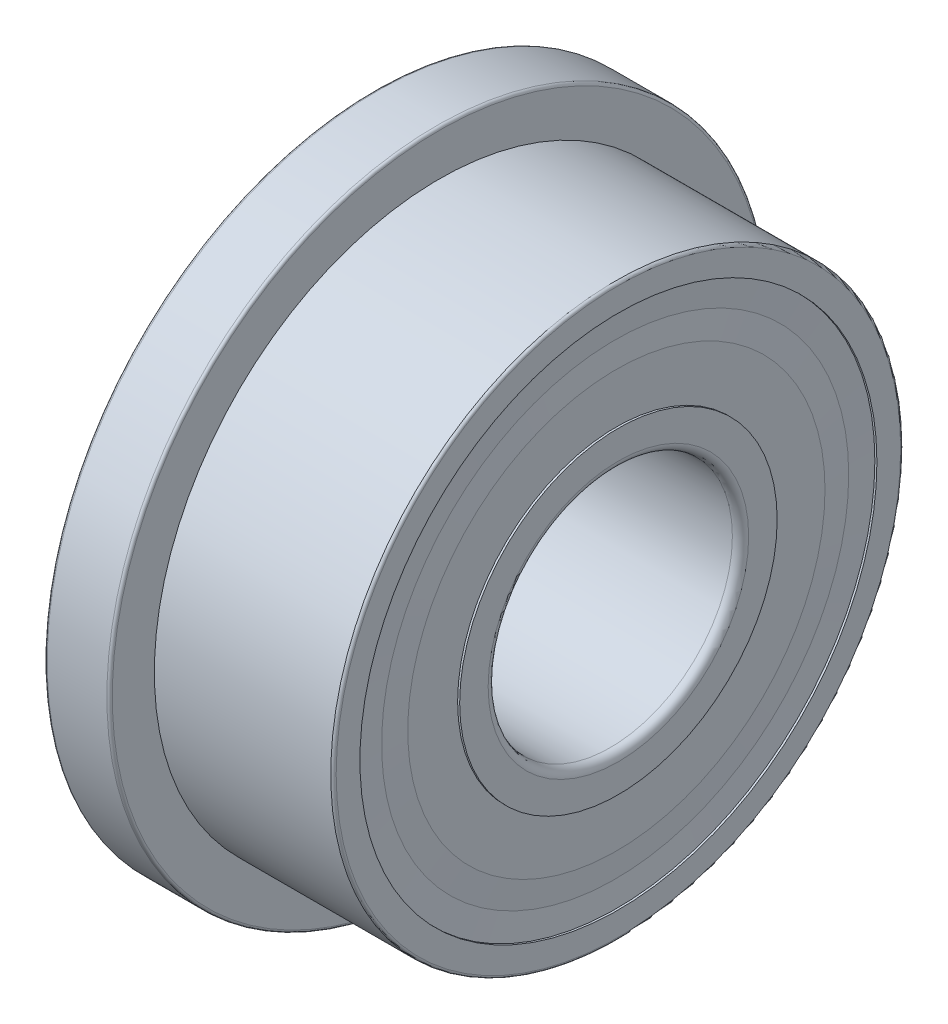
ISO-10303-21;
HEADER;
FILE_DESCRIPTION(('STEP AP214'),'2;1');
FILE_NAME('part.step','',(''),(''),'','','');
FILE_SCHEMA(('AUTOMOTIVE_DESIGN { 1 0 10303 214 1 1 1 1 }'));
ENDSEC;
DATA;
#1=APPLICATION_CONTEXT('core data for automotive mechanical design processes');
#2=APPLICATION_PROTOCOL_DEFINITION('international standard','automotive_design',2000,#1);
#3=PRODUCT_CONTEXT('',#1,'mechanical');
#4=PRODUCT('Part','Part','',(#3));
#5=PRODUCT_RELATED_PRODUCT_CATEGORY('part','',(#4));
#6=PRODUCT_DEFINITION_FORMATION('','',#4);
#7=PRODUCT_DEFINITION_CONTEXT('part definition',#1,'design');
#8=PRODUCT_DEFINITION('design','',#6,#7);
#9=PRODUCT_DEFINITION_SHAPE('','',#8);
#10=(LENGTH_UNIT() NAMED_UNIT(*) SI_UNIT(.MILLI.,.METRE.));
#11=(NAMED_UNIT(*) PLANE_ANGLE_UNIT() SI_UNIT($,.RADIAN.));
#12=(NAMED_UNIT(*) SI_UNIT($,.STERADIAN.) SOLID_ANGLE_UNIT());
#13=UNCERTAINTY_MEASURE_WITH_UNIT(LENGTH_MEASURE(1.E-05),#10,'distance_accuracy_value','');
#14=(GEOMETRIC_REPRESENTATION_CONTEXT(3) GLOBAL_UNCERTAINTY_ASSIGNED_CONTEXT((#13)) GLOBAL_UNIT_ASSIGNED_CONTEXT((#10,
#11,#12)) REPRESENTATION_CONTEXT('',''));
#15=CARTESIAN_POINT('',(0.,0.,0.));
#16=DIRECTION('',(0.,0.,1.));
#17=DIRECTION('',(1.,0.,0.));
#18=AXIS2_PLACEMENT_3D('',#15,#16,#17);
#19=CARTESIAN_POINT('',(2.945,0.,0.));
#20=DIRECTION('',(1.,0.,0.));
#21=DIRECTION('',(0.,0.,-1.));
#22=AXIS2_PLACEMENT_3D('',#19,#20,#21);
#23=CONICAL_SURFACE('',#22,3.175,1.4731486901);
#24=CARTESIAN_POINT('',(2.945,0.,0.));
#25=DIRECTION('',(1.,0.,0.));
#26=DIRECTION('',(0.,0.,-1.));
#27=AXIS2_PLACEMENT_3D('',#24,#25,#26);
#28=CIRCLE('',#27,3.175);
#29=CARTESIAN_POINT('',(2.945,0.,-3.175));
#30=VERTEX_POINT('',#29);
#31=EDGE_CURVE('P0_E37',#30,#30,#28,.T.);
#32=ORIENTED_EDGE('',*,*,#31,.F.);
#33=EDGE_LOOP('',(#32));
#34=FACE_BOUND('',#33,.T.);
#35=CARTESIAN_POINT('',(2.915,0.,0.));
#36=DIRECTION('',(1.,0.,0.));
#37=DIRECTION('',(0.,0.,-1.));
#38=AXIS2_PLACEMENT_3D('',#35,#36,#37);
#39=CIRCLE('',#38,2.86875);
#40=CARTESIAN_POINT('',(2.915,0.,-2.86875));
#41=VERTEX_POINT('',#40);
#42=EDGE_CURVE('P0_E11',#41,#41,#39,.T.);
#43=ORIENTED_EDGE('',*,*,#42,.T.);
#44=EDGE_LOOP('',(#43));
#45=FACE_BOUND('',#44,.T.);
#46=ADVANCED_FACE('P0_F16',(#34,#45),#23,.T.);
#47=CARTESIAN_POINT('',(2.915,2.86875,0.));
#48=DIRECTION('',(-1.,0.,0.));
#49=DIRECTION('',(0.,0.,1.));
#50=AXIS2_PLACEMENT_3D('',#47,#48,#49);
#51=PLANE('',#50);
#52=ORIENTED_EDGE('',*,*,#42,.F.);
#53=EDGE_LOOP('',(#52));
#54=FACE_BOUND('',#53,.T.);
#55=CARTESIAN_POINT('',(2.915,0.,0.));
#56=DIRECTION('',(1.,0.,0.));
#57=DIRECTION('',(0.,0.,-1.));
#58=AXIS2_PLACEMENT_3D('',#55,#56,#57);
#59=CIRCLE('',#58,2.5625);
#60=CARTESIAN_POINT('',(2.915,0.,-2.5625));
#61=VERTEX_POINT('',#60);
#62=EDGE_CURVE('P0_E26',#61,#61,#59,.T.);
#63=ORIENTED_EDGE('',*,*,#62,.T.);
#64=EDGE_LOOP('',(#63));
#65=FACE_BOUND('',#64,.T.);
#66=ADVANCED_FACE('P0_F273',(#54,#65),#51,.T.);
#67=CARTESIAN_POINT('',(2.915,0.,0.));
#68=DIRECTION('',(-1.,0.,0.));
#69=DIRECTION('',(0.,0.,1.));
#70=AXIS2_PLACEMENT_3D('',#67,#68,#69);
#71=CONICAL_SURFACE('',#70,2.5625,1.521855846);
#72=ORIENTED_EDGE('',*,*,#62,.F.);
#73=EDGE_LOOP('',(#72));
#74=FACE_BOUND('',#73,.T.);
#75=CARTESIAN_POINT('',(2.94499385865156,0.,0.));
#76=DIRECTION('',(-1.,0.,0.));
#77=DIRECTION('',(0.,0.,1.));
#78=AXIS2_PLACEMENT_3D('',#75,#76,#77);
#79=CIRCLE('',#78,1.9501253859);
#80=CARTESIAN_POINT('',(2.94499385865156,0.,1.95012538586408));
#81=VERTEX_POINT('',#80);
#82=EDGE_CURVE('P0_E157',#81,#81,#79,.T.);
#83=ORIENTED_EDGE('',*,*,#82,.F.);
#84=EDGE_LOOP('',(#83));
#85=FACE_BOUND('',#84,.T.);
#86=ADVANCED_FACE('P0_F278',(#74,#85),#71,.F.);
#87=CARTESIAN_POINT('',(0.,2.175,0.));
#88=DIRECTION('',(-1.,0.,0.));
#89=DIRECTION('',(0.,0.,1.));
#90=AXIS2_PLACEMENT_3D('',#87,#88,#89);
#91=PLANE('',#90);
#92=CARTESIAN_POINT('',(0.,0.,0.));
#93=DIRECTION('',(1.,0.,0.));
#94=DIRECTION('',(0.,0.,-1.));
#95=AXIS2_PLACEMENT_3D('',#92,#93,#94);
#96=CIRCLE('',#95,1.95);
#97=CARTESIAN_POINT('',(0.,0.,-1.95));
#98=VERTEX_POINT('',#97);
#99=EDGE_CURVE('P0_E178',#98,#98,#96,.T.);
#100=ORIENTED_EDGE('',*,*,#99,.F.);
#101=EDGE_LOOP('',(#100));
#102=FACE_BOUND('',#101,.T.);
#103=CARTESIAN_POINT('',(0.,0.,0.));
#104=DIRECTION('',(1.,0.,0.));
#105=DIRECTION('',(0.,0.,-1.));
#106=AXIS2_PLACEMENT_3D('',#103,#104,#105);
#107=CIRCLE('',#106,1.6);
#108=CARTESIAN_POINT('',(0.,0.,-1.6));
#109=VERTEX_POINT('',#108);
#110=EDGE_CURVE('P0_E191',#109,#109,#107,.T.);
#111=ORIENTED_EDGE('',*,*,#110,.T.);
#112=EDGE_LOOP('',(#111));
#113=FACE_BOUND('',#112,.T.);
#114=ADVANCED_FACE('P0_F300',(#102,#113),#91,.T.);
#115=CARTESIAN_POINT('',(3.,1.6,0.));
#116=DIRECTION('',(1.,0.,0.));
#117=DIRECTION('',(0.,1.,0.));
#118=AXIS2_PLACEMENT_3D('',#115,#116,#117);
#119=PLANE('',#118);
#120=CARTESIAN_POINT('',(3.,0.,0.));
#121=DIRECTION('',(1.,0.,0.));
#122=DIRECTION('',(0.,0.,-1.));
#123=AXIS2_PLACEMENT_3D('',#120,#121,#122);
#124=CIRCLE('',#123,1.95);
#125=CARTESIAN_POINT('',(3.,0.,-1.95));
#126=VERTEX_POINT('',#125);
#127=EDGE_CURVE('P0_E181',#126,#126,#124,.T.);
#128=ORIENTED_EDGE('',*,*,#127,.T.);
#129=EDGE_LOOP('',(#128));
#130=FACE_BOUND('',#129,.T.);
#131=CARTESIAN_POINT('',(3.,0.,0.));
#132=DIRECTION('',(1.,0.,0.));
#133=DIRECTION('',(0.,0.,-1.));
#134=AXIS2_PLACEMENT_3D('',#131,#132,#133);
#135=CIRCLE('',#134,1.6);
#136=CARTESIAN_POINT('',(3.,0.,-1.6));
#137=VERTEX_POINT('',#136);
#138=EDGE_CURVE('P0_E210',#137,#137,#135,.T.);
#139=ORIENTED_EDGE('',*,*,#138,.F.);
#140=EDGE_LOOP('',(#139));
#141=FACE_BOUND('',#140,.T.);
#142=ADVANCED_FACE('P0_F296',(#130,#141),#119,.T.);
#143=CARTESIAN_POINT('',(1.5,0.,0.));
#144=DIRECTION('',(-1.,0.,0.));
#145=DIRECTION('',(0.,0.,-1.));
#146=AXIS2_PLACEMENT_3D('',#143,#144,#145);
#147=CYLINDRICAL_SURFACE('',#146,1.95);
#148=ORIENTED_EDGE('',*,*,#99,.T.);
#149=EDGE_LOOP('',(#148));
#150=FACE_BOUND('',#149,.T.);
#151=CARTESIAN_POINT('',(0.0249999999999972,0.,0.));
#152=DIRECTION('',(1.,0.,0.));
#153=DIRECTION('',(0.,0.,-1.));
#154=AXIS2_PLACEMENT_3D('',#151,#152,#153);
#155=CIRCLE('',#154,1.95);
#156=CARTESIAN_POINT('',(0.0249999999999972,0.,-1.95));
#157=VERTEX_POINT('',#156);
#158=EDGE_CURVE('P0_E172',#157,#157,#155,.T.);
#159=ORIENTED_EDGE('',*,*,#158,.F.);
#160=EDGE_LOOP('',(#159));
#161=FACE_BOUND('',#160,.T.);
#162=ADVANCED_FACE('P0_F299',(#150,#161),#147,.T.);
#163=CARTESIAN_POINT('',(0.05,0.,0.));
#164=DIRECTION('',(1.,0.,0.));
#165=DIRECTION('',(0.,0.,-1.));
#166=AXIS2_PLACEMENT_3D('',#163,#164,#165);
#167=TOROIDAL_SURFACE('',#166,2.05,0.1);
#168=CARTESIAN_POINT('',(0.0550061413484443,0.,0.));
#169=DIRECTION('',(1.,0.,0.));
#170=DIRECTION('',(0.,0.,-1.));
#171=AXIS2_PLACEMENT_3D('',#168,#169,#170);
#172=CIRCLE('',#171,1.9501253859);
#173=CARTESIAN_POINT('',(0.0550061413484443,0.,-1.95012538586408));
#174=VERTEX_POINT('',#173);
#175=EDGE_CURVE('P0_E139',#174,#174,#172,.T.);
#176=ORIENTED_EDGE('',*,*,#175,.T.);
#177=EDGE_LOOP('',(#176));
#178=FACE_BOUND('',#177,.T.);
#179=CARTESIAN_POINT('',(0.15,0.,0.));
#180=DIRECTION('',(1.,0.,0.));
#181=DIRECTION('',(0.,0.,-1.));
#182=AXIS2_PLACEMENT_3D('',#179,#180,#181);
#183=CIRCLE('',#182,2.05);
#184=CARTESIAN_POINT('',(0.15,0.,-2.05));
#185=VERTEX_POINT('',#184);
#186=EDGE_CURVE('P0_E145',#185,#185,#183,.T.);
#187=ORIENTED_EDGE('',*,*,#186,.F.);
#188=EDGE_LOOP('',(#187));
#189=FACE_BOUND('',#188,.T.);
#190=ADVANCED_FACE('P0_F146',(#178,#189),#167,.F.);
#191=CARTESIAN_POINT('',(2.9,0.,0.));
#192=DIRECTION('',(1.,0.,0.));
#193=DIRECTION('',(0.,0.,-1.));
#194=AXIS2_PLACEMENT_3D('',#191,#192,#193);
#195=TOROIDAL_SURFACE('',#194,1.6,0.1);
#196=CARTESIAN_POINT('',(2.9,0.,0.));
#197=DIRECTION('',(1.,0.,0.));
#198=DIRECTION('',(0.,0.,-1.));
#199=AXIS2_PLACEMENT_3D('',#196,#197,#198);
#200=CIRCLE('',#199,1.5);
#201=CARTESIAN_POINT('',(2.9,0.,-1.5));
#202=VERTEX_POINT('',#201);
#203=EDGE_CURVE('P0_E165',#202,#202,#200,.T.);
#204=ORIENTED_EDGE('',*,*,#203,.F.);
#205=EDGE_LOOP('',(#204));
#206=FACE_BOUND('',#205,.T.);
#207=ORIENTED_EDGE('',*,*,#138,.T.);
#208=EDGE_LOOP('',(#207));
#209=FACE_BOUND('',#208,.T.);
#210=ADVANCED_FACE('P0_F289',(#206,#209),#195,.T.);
#211=CARTESIAN_POINT('',(1.5,0.,0.));
#212=DIRECTION('',(-1.,0.,0.));
#213=DIRECTION('',(0.,0.,-1.));
#214=AXIS2_PLACEMENT_3D('',#211,#212,#213);
#215=CYLINDRICAL_SURFACE('',#214,2.175);
#216=CARTESIAN_POINT('',(1.12003289616073,0.,0.));
#217=DIRECTION('',(1.,0.,0.));
#218=DIRECTION('',(0.,0.,-1.));
#219=AXIS2_PLACEMENT_3D('',#216,#217,#218);
#220=CIRCLE('',#219,2.175);
#221=CARTESIAN_POINT('',(1.12003289616073,0.,-2.175));
#222=VERTEX_POINT('',#221);
#223=EDGE_CURVE('P0_E187',#222,#222,#220,.T.);
#224=ORIENTED_EDGE('',*,*,#223,.F.);
#225=EDGE_LOOP('',(#224));
#226=FACE_BOUND('',#225,.T.);
#227=CARTESIAN_POINT('',(0.15,0.,0.));
#228=DIRECTION('',(-1.,0.,0.));
#229=DIRECTION('',(0.,0.,-1.));
#230=AXIS2_PLACEMENT_3D('',#227,#228,#229);
#231=CIRCLE('',#230,2.175);
#232=CARTESIAN_POINT('',(0.15,0.,-2.175));
#233=VERTEX_POINT('',#232);
#234=EDGE_CURVE('P0_E149',#233,#233,#231,.T.);
#235=ORIENTED_EDGE('',*,*,#234,.F.);
#236=EDGE_LOOP('',(#235));
#237=FACE_BOUND('',#236,.T.);
#238=ADVANCED_FACE('P0_F285',(#226,#237),#215,.T.);
#239=CARTESIAN_POINT('',(1.5,0.,0.));
#240=DIRECTION('',(1.,0.,0.));
#241=DIRECTION('',(0.,0.,-1.));
#242=AXIS2_PLACEMENT_3D('',#239,#240,#241);
#243=TOROIDAL_SURFACE('',#242,2.5,0.5);
#244=ORIENTED_EDGE('',*,*,#223,.T.);
#245=EDGE_LOOP('',(#244));
#246=FACE_BOUND('',#245,.T.);
#247=CARTESIAN_POINT('',(1.87996710383927,0.,0.));
#248=DIRECTION('',(1.,0.,0.));
#249=DIRECTION('',(0.,0.,-1.));
#250=AXIS2_PLACEMENT_3D('',#247,#248,#249);
#251=CIRCLE('',#250,2.175);
#252=CARTESIAN_POINT('',(1.87996710383927,0.,-2.175));
#253=VERTEX_POINT('',#252);
#254=EDGE_CURVE('P0_E183',#253,#253,#251,.T.);
#255=ORIENTED_EDGE('',*,*,#254,.F.);
#256=EDGE_LOOP('',(#255));
#257=FACE_BOUND('',#256,.T.);
#258=ADVANCED_FACE('P0_F288',(#246,#257),#243,.F.);
#259=CARTESIAN_POINT('',(1.5,0.,0.));
#260=DIRECTION('',(-1.,0.,0.));
#261=DIRECTION('',(0.,0.,-1.));
#262=AXIS2_PLACEMENT_3D('',#259,#260,#261);
#263=CYLINDRICAL_SURFACE('',#262,2.175);
#264=CARTESIAN_POINT('',(2.85,0.,0.));
#265=DIRECTION('',(1.,0.,0.));
#266=DIRECTION('',(0.,0.,1.));
#267=AXIS2_PLACEMENT_3D('',#264,#265,#266);
#268=CIRCLE('',#267,2.175);
#269=CARTESIAN_POINT('',(2.85,0.,2.175));
#270=VERTEX_POINT('',#269);
#271=EDGE_CURVE('P0_E215',#270,#270,#268,.T.);
#272=ORIENTED_EDGE('',*,*,#271,.F.);
#273=EDGE_LOOP('',(#272));
#274=FACE_BOUND('',#273,.T.);
#275=ORIENTED_EDGE('',*,*,#254,.T.);
#276=EDGE_LOOP('',(#275));
#277=FACE_BOUND('',#276,.T.);
#278=ADVANCED_FACE('P0_F329',(#274,#277),#263,.T.);
#279=CARTESIAN_POINT('',(1.5,0.,0.));
#280=DIRECTION('',(-1.,0.,0.));
#281=DIRECTION('',(0.,0.,-1.));
#282=AXIS2_PLACEMENT_3D('',#279,#280,#281);
#283=CYLINDRICAL_SURFACE('',#282,1.5);
#284=CARTESIAN_POINT('',(0.1,0.,0.));
#285=DIRECTION('',(1.,0.,0.));
#286=DIRECTION('',(0.,0.,-1.));
#287=AXIS2_PLACEMENT_3D('',#284,#285,#286);
#288=CIRCLE('',#287,1.5);
#289=CARTESIAN_POINT('',(0.1,0.,-1.5));
#290=VERTEX_POINT('',#289);
#291=EDGE_CURVE('P0_E192',#290,#290,#288,.T.);
#292=ORIENTED_EDGE('',*,*,#291,.F.);
#293=EDGE_LOOP('',(#292));
#294=FACE_BOUND('',#293,.T.);
#295=ORIENTED_EDGE('',*,*,#203,.T.);
#296=EDGE_LOOP('',(#295));
#297=FACE_BOUND('',#296,.T.);
#298=ADVANCED_FACE('P0_F317',(#294,#297),#283,.F.);
#299=CARTESIAN_POINT('',(0.1,0.,0.));
#300=DIRECTION('',(1.,0.,0.));
#301=DIRECTION('',(0.,0.,-1.));
#302=AXIS2_PLACEMENT_3D('',#299,#300,#301);
#303=TOROIDAL_SURFACE('',#302,1.6,0.1);
#304=ORIENTED_EDGE('',*,*,#110,.F.);
#305=EDGE_LOOP('',(#304));
#306=FACE_BOUND('',#305,.T.);
#307=ORIENTED_EDGE('',*,*,#291,.T.);
#308=EDGE_LOOP('',(#307));
#309=FACE_BOUND('',#308,.T.);
#310=ADVANCED_FACE('P0_F313',(#306,#309),#303,.T.);
#311=CARTESIAN_POINT('',(1.5,0.,0.));
#312=DIRECTION('',(-1.,0.,0.));
#313=DIRECTION('',(0.,0.,-1.));
#314=AXIS2_PLACEMENT_3D('',#311,#312,#313);
#315=CYLINDRICAL_SURFACE('',#314,1.95);
#316=CARTESIAN_POINT('',(2.975,0.,0.));
#317=DIRECTION('',(1.,0.,0.));
#318=DIRECTION('',(0.,0.,-1.));
#319=AXIS2_PLACEMENT_3D('',#316,#317,#318);
#320=CIRCLE('',#319,1.95);
#321=CARTESIAN_POINT('',(2.975,0.,-1.95));
#322=VERTEX_POINT('',#321);
#323=EDGE_CURVE('P0_E196',#322,#322,#320,.T.);
#324=ORIENTED_EDGE('',*,*,#323,.T.);
#325=EDGE_LOOP('',(#324));
#326=FACE_BOUND('',#325,.T.);
#327=ORIENTED_EDGE('',*,*,#127,.F.);
#328=EDGE_LOOP('',(#327));
#329=FACE_BOUND('',#328,.T.);
#330=ADVANCED_FACE('P0_F310',(#326,#329),#315,.T.);
#331=CARTESIAN_POINT('',(2.85,3.1,0.));
#332=DIRECTION('',(-1.,0.,0.));
#333=DIRECTION('',(0.,0.,1.));
#334=AXIS2_PLACEMENT_3D('',#331,#332,#333);
#335=PLANE('',#334);
#336=ORIENTED_EDGE('',*,*,#271,.T.);
#337=EDGE_LOOP('',(#336));
#338=FACE_BOUND('',#337,.T.);
#339=CARTESIAN_POINT('',(2.85,0.,0.));
#340=DIRECTION('',(1.,0.,0.));
#341=DIRECTION('',(0.,0.,-1.));
#342=AXIS2_PLACEMENT_3D('',#339,#340,#341);
#343=CIRCLE('',#342,2.05);
#344=CARTESIAN_POINT('',(2.85,0.,-2.05));
#345=VERTEX_POINT('',#344);
#346=EDGE_CURVE('P0_E211',#345,#345,#343,.T.);
#347=ORIENTED_EDGE('',*,*,#346,.F.);
#348=EDGE_LOOP('',(#347));
#349=FACE_BOUND('',#348,.T.);
#350=ADVANCED_FACE('P0_F307',(#338,#349),#335,.F.);
#351=CARTESIAN_POINT('',(2.95,0.,0.));
#352=DIRECTION('',(1.,0.,0.));
#353=DIRECTION('',(0.,0.,-1.));
#354=AXIS2_PLACEMENT_3D('',#351,#352,#353);
#355=TOROIDAL_SURFACE('',#354,2.05,0.1);
#356=ORIENTED_EDGE('',*,*,#346,.T.);
#357=EDGE_LOOP('',(#356));
#358=FACE_BOUND('',#357,.T.);
#359=ORIENTED_EDGE('',*,*,#82,.T.);
#360=EDGE_LOOP('',(#359));
#361=FACE_BOUND('',#360,.T.);
#362=ADVANCED_FACE('P0_F305',(#358,#361),#355,.F.);
#363=CARTESIAN_POINT('',(0.15,2.05,0.));
#364=DIRECTION('',(1.,0.,0.));
#365=DIRECTION('',(0.,1.,0.));
#366=AXIS2_PLACEMENT_3D('',#363,#364,#365);
#367=PLANE('',#366);
#368=ORIENTED_EDGE('',*,*,#234,.T.);
#369=EDGE_LOOP('',(#368));
#370=FACE_BOUND('',#369,.T.);
#371=ORIENTED_EDGE('',*,*,#186,.T.);
#372=EDGE_LOOP('',(#371));
#373=FACE_BOUND('',#372,.T.);
#374=ADVANCED_FACE('P0_F18',(#370,#373),#367,.F.);
#375=CARTESIAN_POINT('',(50.,0.,0.));
#376=DIRECTION('',(-1.,0.,0.));
#377=DIRECTION('',(0.,0.,-1.));
#378=AXIS2_PLACEMENT_3D('',#375,#376,#377);
#379=CYLINDRICAL_SURFACE('',#378,3.175);
#380=CARTESIAN_POINT('',(0.055,0.,0.));
#381=DIRECTION('',(1.,0.,0.));
#382=DIRECTION('',(0.,0.,-1.));
#383=AXIS2_PLACEMENT_3D('',#380,#381,#382);
#384=CIRCLE('',#383,3.175);
#385=CARTESIAN_POINT('',(0.055,0.,-3.175));
#386=VERTEX_POINT('',#385);
#387=EDGE_CURVE('P0_E170',#386,#386,#384,.T.);
#388=ORIENTED_EDGE('',*,*,#387,.F.);
#389=EDGE_LOOP('',(#388));
#390=FACE_BOUND('',#389,.T.);
#391=CARTESIAN_POINT('',(0.0249999999999972,0.,0.));
#392=DIRECTION('',(1.,0.,0.));
#393=DIRECTION('',(0.,0.,-1.));
#394=AXIS2_PLACEMENT_3D('',#391,#392,#393);
#395=CIRCLE('',#394,3.175);
#396=CARTESIAN_POINT('',(0.0249999999999972,0.,-3.175));
#397=VERTEX_POINT('',#396);
#398=EDGE_CURVE('P0_E150',#397,#397,#395,.T.);
#399=ORIENTED_EDGE('',*,*,#398,.T.);
#400=EDGE_LOOP('',(#399));
#401=FACE_BOUND('',#400,.T.);
#402=ADVANCED_FACE('P0_F337',(#390,#401),#379,.T.);
#403=CARTESIAN_POINT('',(0.0249999999999972,0.,0.));
#404=DIRECTION('',(-1.,0.,0.));
#405=DIRECTION('',(0.,0.,1.));
#406=AXIS2_PLACEMENT_3D('',#403,#404,#405);
#407=CONICAL_SURFACE('',#406,3.175,1.521855846);
#408=ORIENTED_EDGE('',*,*,#398,.F.);
#409=EDGE_LOOP('',(#408));
#410=FACE_BOUND('',#409,.T.);
#411=CARTESIAN_POINT('',(0.0399999999999984,0.,0.));
#412=DIRECTION('',(1.,0.,0.));
#413=DIRECTION('',(0.,0.,-1.));
#414=AXIS2_PLACEMENT_3D('',#411,#412,#413);
#415=CIRCLE('',#414,2.86875);
#416=CARTESIAN_POINT('',(0.0399999999999984,0.,-2.86875));
#417=VERTEX_POINT('',#416);
#418=EDGE_CURVE('P0_E161',#417,#417,#415,.T.);
#419=ORIENTED_EDGE('',*,*,#418,.T.);
#420=EDGE_LOOP('',(#419));
#421=FACE_BOUND('',#420,.T.);
#422=ADVANCED_FACE('P0_F294',(#410,#421),#407,.F.);
#423=CARTESIAN_POINT('',(0.0399999999999984,0.,0.));
#424=DIRECTION('',(1.,0.,0.));
#425=DIRECTION('',(0.,0.,-1.));
#426=AXIS2_PLACEMENT_3D('',#423,#424,#425);
#427=CONICAL_SURFACE('',#426,2.86875,1.521855846);
#428=ORIENTED_EDGE('',*,*,#418,.F.);
#429=EDGE_LOOP('',(#428));
#430=FACE_BOUND('',#429,.T.);
#431=CARTESIAN_POINT('',(0.0249999999999972,0.,0.));
#432=DIRECTION('',(1.,0.,0.));
#433=DIRECTION('',(0.,0.,-1.));
#434=AXIS2_PLACEMENT_3D('',#431,#432,#433);
#435=CIRCLE('',#434,2.5625);
#436=CARTESIAN_POINT('',(0.0249999999999972,0.,-2.5625));
#437=VERTEX_POINT('',#436);
#438=EDGE_CURVE('P0_E176',#437,#437,#435,.T.);
#439=ORIENTED_EDGE('',*,*,#438,.T.);
#440=EDGE_LOOP('',(#439));
#441=FACE_BOUND('',#440,.T.);
#442=ADVANCED_FACE('P0_F291',(#430,#441),#427,.T.);
#443=CARTESIAN_POINT('',(0.025,2.5625,0.));
#444=DIRECTION('',(-1.,0.,0.));
#445=DIRECTION('',(0.,0.,1.));
#446=AXIS2_PLACEMENT_3D('',#443,#444,#445);
#447=PLANE('',#446);
#448=ORIENTED_EDGE('',*,*,#438,.F.);
#449=EDGE_LOOP('',(#448));
#450=FACE_BOUND('',#449,.T.);
#451=ORIENTED_EDGE('',*,*,#158,.T.);
#452=EDGE_LOOP('',(#451));
#453=FACE_BOUND('',#452,.T.);
#454=ADVANCED_FACE('P0_F269',(#450,#453),#447,.T.);
#455=CARTESIAN_POINT('',(0.055,0.,0.));
#456=DIRECTION('',(1.,0.,0.));
#457=DIRECTION('',(0.,0.,-1.));
#458=AXIS2_PLACEMENT_3D('',#455,#456,#457);
#459=CONICAL_SURFACE('',#458,1.95,1.521855846);
#460=CARTESIAN_POINT('',(0.0850000000000017,0.,0.));
#461=DIRECTION('',(1.,0.,0.));
#462=DIRECTION('',(0.,0.,-1.));
#463=AXIS2_PLACEMENT_3D('',#460,#461,#462);
#464=CIRCLE('',#463,2.5625);
#465=CARTESIAN_POINT('',(0.0850000000000017,0.,-2.5625));
#466=VERTEX_POINT('',#465);
#467=EDGE_CURVE('P0_E177',#466,#466,#464,.T.);
#468=ORIENTED_EDGE('',*,*,#467,.T.);
#469=EDGE_LOOP('',(#468));
#470=FACE_BOUND('',#469,.T.);
#471=ORIENTED_EDGE('',*,*,#175,.F.);
#472=EDGE_LOOP('',(#471));
#473=FACE_BOUND('',#472,.T.);
#474=ADVANCED_FACE('P0_F254',(#470,#473),#459,.F.);
#475=CARTESIAN_POINT('',(0.085,2.5625,0.));
#476=DIRECTION('',(1.,0.,0.));
#477=DIRECTION('',(0.,1.,0.));
#478=AXIS2_PLACEMENT_3D('',#475,#476,#477);
#479=PLANE('',#478);
#480=CARTESIAN_POINT('',(0.0850000000000017,0.,0.));
#481=DIRECTION('',(1.,0.,0.));
#482=DIRECTION('',(0.,0.,-1.));
#483=AXIS2_PLACEMENT_3D('',#480,#481,#482);
#484=CIRCLE('',#483,2.86875);
#485=CARTESIAN_POINT('',(0.0850000000000017,0.,-2.86875));
#486=VERTEX_POINT('',#485);
#487=EDGE_CURVE('P0_E200',#486,#486,#484,.T.);
#488=ORIENTED_EDGE('',*,*,#487,.T.);
#489=EDGE_LOOP('',(#488));
#490=FACE_BOUND('',#489,.T.);
#491=ORIENTED_EDGE('',*,*,#467,.F.);
#492=EDGE_LOOP('',(#491));
#493=FACE_BOUND('',#492,.T.);
#494=ADVANCED_FACE('P0_F256',(#490,#493),#479,.T.);
#495=CARTESIAN_POINT('',(0.0850000000000017,0.,0.));
#496=DIRECTION('',(-1.,0.,0.));
#497=DIRECTION('',(0.,0.,1.));
#498=AXIS2_PLACEMENT_3D('',#495,#496,#497);
#499=CONICAL_SURFACE('',#498,2.86875,1.4731486901);
#500=ORIENTED_EDGE('',*,*,#387,.T.);
#501=EDGE_LOOP('',(#500));
#502=FACE_BOUND('',#501,.T.);
#503=ORIENTED_EDGE('',*,*,#487,.F.);
#504=EDGE_LOOP('',(#503));
#505=FACE_BOUND('',#504,.T.);
#506=ADVANCED_FACE('P0_F258',(#502,#505),#499,.T.);
#507=CARTESIAN_POINT('',(2.975,1.95,0.));
#508=DIRECTION('',(1.,0.,0.));
#509=DIRECTION('',(0.,1.,0.));
#510=AXIS2_PLACEMENT_3D('',#507,#508,#509);
#511=PLANE('',#510);
#512=CARTESIAN_POINT('',(2.975,0.,0.));
#513=DIRECTION('',(1.,0.,0.));
#514=DIRECTION('',(0.,0.,-1.));
#515=AXIS2_PLACEMENT_3D('',#512,#513,#514);
#516=CIRCLE('',#515,2.5625);
#517=CARTESIAN_POINT('',(2.975,0.,-2.5625));
#518=VERTEX_POINT('',#517);
#519=EDGE_CURVE('P0_E167',#518,#518,#516,.T.);
#520=ORIENTED_EDGE('',*,*,#519,.T.);
#521=EDGE_LOOP('',(#520));
#522=FACE_BOUND('',#521,.T.);
#523=ORIENTED_EDGE('',*,*,#323,.F.);
#524=EDGE_LOOP('',(#523));
#525=FACE_BOUND('',#524,.T.);
#526=ADVANCED_FACE('P0_F266',(#522,#525),#511,.T.);
#527=CARTESIAN_POINT('',(2.975,0.,0.));
#528=DIRECTION('',(-1.,0.,0.));
#529=DIRECTION('',(0.,0.,1.));
#530=AXIS2_PLACEMENT_3D('',#527,#528,#529);
#531=CONICAL_SURFACE('',#530,2.5625,1.521855846);
#532=CARTESIAN_POINT('',(2.96,0.,0.));
#533=DIRECTION('',(1.,0.,0.));
#534=DIRECTION('',(0.,0.,-1.));
#535=AXIS2_PLACEMENT_3D('',#532,#533,#534);
#536=CIRCLE('',#535,2.86875);
#537=CARTESIAN_POINT('',(2.96,0.,-2.86875));
#538=VERTEX_POINT('',#537);
#539=EDGE_CURVE('P0_E171',#538,#538,#536,.T.);
#540=ORIENTED_EDGE('',*,*,#539,.T.);
#541=EDGE_LOOP('',(#540));
#542=FACE_BOUND('',#541,.T.);
#543=ORIENTED_EDGE('',*,*,#519,.F.);
#544=EDGE_LOOP('',(#543));
#545=FACE_BOUND('',#544,.T.);
#546=ADVANCED_FACE('P0_F322',(#542,#545),#531,.T.);
#547=CARTESIAN_POINT('',(2.96,0.,0.));
#548=DIRECTION('',(1.,0.,0.));
#549=DIRECTION('',(0.,0.,-1.));
#550=AXIS2_PLACEMENT_3D('',#547,#548,#549);
#551=CONICAL_SURFACE('',#550,2.86875,1.521855846);
#552=CARTESIAN_POINT('',(2.975,0.,0.));
#553=DIRECTION('',(1.,0.,0.));
#554=DIRECTION('',(0.,0.,-1.));
#555=AXIS2_PLACEMENT_3D('',#552,#553,#554);
#556=CIRCLE('',#555,3.175);
#557=CARTESIAN_POINT('',(2.975,0.,-3.175));
#558=VERTEX_POINT('',#557);
#559=EDGE_CURVE('P0_E227',#558,#558,#556,.T.);
#560=ORIENTED_EDGE('',*,*,#559,.T.);
#561=EDGE_LOOP('',(#560));
#562=FACE_BOUND('',#561,.T.);
#563=ORIENTED_EDGE('',*,*,#539,.F.);
#564=EDGE_LOOP('',(#563));
#565=FACE_BOUND('',#564,.T.);
#566=ADVANCED_FACE('P0_F325',(#562,#565),#551,.F.);
#567=CARTESIAN_POINT('',(50.,0.,0.));
#568=DIRECTION('',(-1.,0.,0.));
#569=DIRECTION('',(0.,0.,-1.));
#570=AXIS2_PLACEMENT_3D('',#567,#568,#569);
#571=CYLINDRICAL_SURFACE('',#570,3.175);
#572=ORIENTED_EDGE('',*,*,#559,.F.);
#573=EDGE_LOOP('',(#572));
#574=FACE_BOUND('',#573,.T.);
#575=ORIENTED_EDGE('',*,*,#31,.T.);
#576=EDGE_LOOP('',(#575));
#577=FACE_BOUND('',#576,.T.);
#578=ADVANCED_FACE('P0_F284',(#574,#577),#571,.T.);
#579=CLOSED_SHELL('',(#46,#66,#86,#114,#142,#162,#190,#210,#238,#258,#278,#298,#310,#330,#350,
#362,#374,#402,#422,#442,#454,#474,#494,#506,#526,#546,#566,#578));
#580=MANIFOLD_SOLID_BREP('P0_B1',#579);
#581=CARTESIAN_POINT('',(0.0333333333333321,0.,0.));
#582=DIRECTION('',(1.,0.,0.));
#583=DIRECTION('',(0.,0.,-1.));
#584=AXIS2_PLACEMENT_3D('',#581,#582,#583);
#585=TOROIDAL_SURFACE('',#584,4.0166666667,0.0333333333);
#586=CARTESIAN_POINT('',(0.0333333333333366,0.,0.));
#587=DIRECTION('',(1.,0.,0.));
#588=DIRECTION('',(0.,0.,-1.));
#589=AXIS2_PLACEMENT_3D('',#586,#587,#588);
#590=CIRCLE('',#589,4.05);
#591=CARTESIAN_POINT('',(0.0333333333333366,0.,-4.05));
#592=VERTEX_POINT('',#591);
#593=EDGE_CURVE('P1_E39',#592,#592,#590,.T.);
#594=ORIENTED_EDGE('',*,*,#593,.F.);
#595=EDGE_LOOP('',(#594));
#596=FACE_BOUND('',#595,.T.);
#597=CARTESIAN_POINT('',(0.,0.,0.));
#598=DIRECTION('',(1.,0.,0.));
#599=DIRECTION('',(0.,0.,-1.));
#600=AXIS2_PLACEMENT_3D('',#597,#598,#599);
#601=CIRCLE('',#600,4.0166666667);
#602=CARTESIAN_POINT('',(0.,0.,-4.01666666666667));
#603=VERTEX_POINT('',#602);
#604=EDGE_CURVE('P1_E11',#603,#603,#601,.T.);
#605=ORIENTED_EDGE('',*,*,#604,.T.);
#606=EDGE_LOOP('',(#605));
#607=FACE_BOUND('',#606,.T.);
#608=ADVANCED_FACE('P1_F16',(#596,#607),#585,.T.);
#609=CARTESIAN_POINT('',(0.,4.01666666666667,0.));
#610=DIRECTION('',(-1.,0.,0.));
#611=DIRECTION('',(0.,0.,1.));
#612=AXIS2_PLACEMENT_3D('',#609,#610,#611);
#613=PLANE('',#612);
#614=ORIENTED_EDGE('',*,*,#604,.F.);
#615=EDGE_LOOP('',(#614));
#616=FACE_BOUND('',#615,.T.);
#617=CARTESIAN_POINT('',(0.,0.,0.));
#618=DIRECTION('',(1.,0.,0.));
#619=DIRECTION('',(0.,0.,-1.));
#620=AXIS2_PLACEMENT_3D('',#617,#618,#619);
#621=CIRCLE('',#620,3.175);
#622=CARTESIAN_POINT('',(0.,0.,-3.175));
#623=VERTEX_POINT('',#622);
#624=EDGE_CURVE('P1_E27',#623,#623,#621,.T.);
#625=ORIENTED_EDGE('',*,*,#624,.T.);
#626=EDGE_LOOP('',(#625));
#627=FACE_BOUND('',#626,.T.);
#628=ADVANCED_FACE('P1_F185',(#616,#627),#613,.T.);
#629=CARTESIAN_POINT('',(50.,0.,0.));
#630=DIRECTION('',(-1.,0.,0.));
#631=DIRECTION('',(0.,0.,-1.));
#632=AXIS2_PLACEMENT_3D('',#629,#630,#631);
#633=CYLINDRICAL_SURFACE('',#632,3.175);
#634=ORIENTED_EDGE('',*,*,#624,.F.);
#635=EDGE_LOOP('',(#634));
#636=FACE_BOUND('',#635,.T.);
#637=CARTESIAN_POINT('',(0.0500000000000014,0.,0.));
#638=DIRECTION('',(1.,0.,0.));
#639=DIRECTION('',(0.,0.,-1.));
#640=AXIS2_PLACEMENT_3D('',#637,#638,#639);
#641=CIRCLE('',#640,3.175);
#642=CARTESIAN_POINT('',(0.0500000000000014,0.,-3.175));
#643=VERTEX_POINT('',#642);
#644=EDGE_CURVE('P1_E231',#643,#643,#641,.T.);
#645=ORIENTED_EDGE('',*,*,#644,.T.);
#646=EDGE_LOOP('',(#645));
#647=FACE_BOUND('',#646,.T.);
#648=ADVANCED_FACE('P1_F189',(#636,#647),#633,.F.);
#649=CARTESIAN_POINT('',(0.0500000000000009,0.,0.));
#650=DIRECTION('',(1.,0.,0.));
#651=DIRECTION('',(0.,0.,-1.));
#652=AXIS2_PLACEMENT_3D('',#649,#650,#651);
#653=TOROIDAL_SURFACE('',#652,3.075,0.1);
#654=CARTESIAN_POINT('',(0.149999999999997,0.,0.));
#655=DIRECTION('',(1.,0.,0.));
#656=DIRECTION('',(0.,0.,-1.));
#657=AXIS2_PLACEMENT_3D('',#654,#655,#656);
#658=CIRCLE('',#657,3.075);
#659=CARTESIAN_POINT('',(0.149999999999997,0.,-3.075));
#660=VERTEX_POINT('',#659);
#661=EDGE_CURVE('P1_E71',#660,#660,#658,.T.);
#662=ORIENTED_EDGE('',*,*,#661,.T.);
#663=EDGE_LOOP('',(#662));
#664=FACE_BOUND('',#663,.T.);
#665=ORIENTED_EDGE('',*,*,#644,.F.);
#666=EDGE_LOOP('',(#665));
#667=FACE_BOUND('',#666,.T.);
#668=ADVANCED_FACE('P1_F194',(#664,#667),#653,.F.);
#669=CARTESIAN_POINT('',(0.15,3.075,0.));
#670=DIRECTION('',(-1.,0.,0.));
#671=DIRECTION('',(0.,0.,1.));
#672=AXIS2_PLACEMENT_3D('',#669,#670,#671);
#673=PLANE('',#672);
#674=ORIENTED_EDGE('',*,*,#661,.F.);
#675=EDGE_LOOP('',(#674));
#676=FACE_BOUND('',#675,.T.);
#677=CARTESIAN_POINT('',(0.149999999999997,0.,0.));
#678=DIRECTION('',(1.,0.,0.));
#679=DIRECTION('',(0.,0.,-1.));
#680=AXIS2_PLACEMENT_3D('',#677,#678,#679);
#681=CIRCLE('',#680,2.835);
#682=CARTESIAN_POINT('',(0.149999999999997,0.,-2.835));
#683=VERTEX_POINT('',#682);
#684=EDGE_CURVE('P1_E83',#683,#683,#681,.T.);
#685=ORIENTED_EDGE('',*,*,#684,.T.);
#686=EDGE_LOOP('',(#685));
#687=FACE_BOUND('',#686,.T.);
#688=ADVANCED_FACE('P1_F197',(#676,#687),#673,.T.);
#689=CARTESIAN_POINT('',(50.,0.,0.));
#690=DIRECTION('',(-1.,0.,0.));
#691=DIRECTION('',(0.,0.,-1.));
#692=AXIS2_PLACEMENT_3D('',#689,#690,#691);
#693=CYLINDRICAL_SURFACE('',#692,2.835);
#694=ORIENTED_EDGE('',*,*,#684,.F.);
#695=EDGE_LOOP('',(#694));
#696=FACE_BOUND('',#695,.T.);
#697=CARTESIAN_POINT('',(1.12881945094065,0.,0.));
#698=DIRECTION('',(1.,0.,0.));
#699=DIRECTION('',(0.,0.,-1.));
#700=AXIS2_PLACEMENT_3D('',#697,#698,#699);
#701=CIRCLE('',#700,2.835);
#702=CARTESIAN_POINT('',(1.12881945094065,0.,-2.835));
#703=VERTEX_POINT('',#702);
#704=EDGE_CURVE('P1_E140',#703,#703,#701,.T.);
#705=ORIENTED_EDGE('',*,*,#704,.T.);
#706=EDGE_LOOP('',(#705));
#707=FACE_BOUND('',#706,.T.);
#708=ADVANCED_FACE('P1_F284',(#696,#707),#693,.F.);
#709=CARTESIAN_POINT('',(1.5,0.,0.));
#710=DIRECTION('',(1.,0.,0.));
#711=DIRECTION('',(0.,0.,-1.));
#712=AXIS2_PLACEMENT_3D('',#709,#710,#711);
#713=TOROIDAL_SURFACE('',#712,2.5,0.5);
#714=CARTESIAN_POINT('',(1.87118054905935,0.,0.));
#715=DIRECTION('',(1.,0.,0.));
#716=DIRECTION('',(0.,0.,-1.));
#717=AXIS2_PLACEMENT_3D('',#714,#715,#716);
#718=CIRCLE('',#717,2.835);
#719=CARTESIAN_POINT('',(1.87118054905935,0.,-2.835));
#720=VERTEX_POINT('',#719);
#721=EDGE_CURVE('P1_E136',#720,#720,#718,.T.);
#722=ORIENTED_EDGE('',*,*,#721,.T.);
#723=EDGE_LOOP('',(#722));
#724=FACE_BOUND('',#723,.T.);
#725=ORIENTED_EDGE('',*,*,#704,.F.);
#726=EDGE_LOOP('',(#725));
#727=FACE_BOUND('',#726,.T.);
#728=CARTESIAN_POINT('',(1.5,0.,-3.));
#729=VERTEX_POINT('',#728);
#730=VERTEX_LOOP('',#729);
#731=FACE_BOUND('',#730,.T.);
#732=ADVANCED_FACE('P1_F211',(#724,#727,#731),#713,.F.);
#733=CARTESIAN_POINT('',(50.,0.,0.));
#734=DIRECTION('',(-1.,0.,0.));
#735=DIRECTION('',(0.,0.,-1.));
#736=AXIS2_PLACEMENT_3D('',#733,#734,#735);
#737=CYLINDRICAL_SURFACE('',#736,2.835);
#738=ORIENTED_EDGE('',*,*,#721,.F.);
#739=EDGE_LOOP('',(#738));
#740=FACE_BOUND('',#739,.T.);
#741=CARTESIAN_POINT('',(2.85,0.,0.));
#742=DIRECTION('',(1.,0.,0.));
#743=DIRECTION('',(0.,0.,-1.));
#744=AXIS2_PLACEMENT_3D('',#741,#742,#743);
#745=CIRCLE('',#744,2.835);
#746=CARTESIAN_POINT('',(2.85,0.,-2.835));
#747=VERTEX_POINT('',#746);
#748=EDGE_CURVE('P1_E141',#747,#747,#745,.T.);
#749=ORIENTED_EDGE('',*,*,#748,.T.);
#750=EDGE_LOOP('',(#749));
#751=FACE_BOUND('',#750,.T.);
#752=ADVANCED_FACE('P1_F208',(#740,#751),#737,.F.);
#753=CARTESIAN_POINT('',(2.85,2.835,0.));
#754=DIRECTION('',(1.,0.,0.));
#755=DIRECTION('',(0.,1.,0.));
#756=AXIS2_PLACEMENT_3D('',#753,#754,#755);
#757=PLANE('',#756);
#758=CARTESIAN_POINT('',(2.85,0.,0.));
#759=DIRECTION('',(1.,0.,0.));
#760=DIRECTION('',(0.,0.,-1.));
#761=AXIS2_PLACEMENT_3D('',#758,#759,#760);
#762=CIRCLE('',#761,3.075);
#763=CARTESIAN_POINT('',(2.85,0.,-3.075));
#764=VERTEX_POINT('',#763);
#765=EDGE_CURVE('P1_E129',#764,#764,#762,.T.);
#766=ORIENTED_EDGE('',*,*,#765,.T.);
#767=EDGE_LOOP('',(#766));
#768=FACE_BOUND('',#767,.T.);
#769=ORIENTED_EDGE('',*,*,#748,.F.);
#770=EDGE_LOOP('',(#769));
#771=FACE_BOUND('',#770,.T.);
#772=ADVANCED_FACE('P1_F206',(#768,#771),#757,.T.);
#773=CARTESIAN_POINT('',(2.95,0.,0.));
#774=DIRECTION('',(1.,0.,0.));
#775=DIRECTION('',(0.,0.,-1.));
#776=AXIS2_PLACEMENT_3D('',#773,#774,#775);
#777=TOROIDAL_SURFACE('',#776,3.075,0.1);
#778=CARTESIAN_POINT('',(2.95,0.,0.));
#779=DIRECTION('',(1.,0.,0.));
#780=DIRECTION('',(0.,0.,-1.));
#781=AXIS2_PLACEMENT_3D('',#778,#779,#780);
#782=CIRCLE('',#781,3.175);
#783=CARTESIAN_POINT('',(2.95,0.,-3.175));
#784=VERTEX_POINT('',#783);
#785=EDGE_CURVE('P1_E134',#784,#784,#782,.T.);
#786=ORIENTED_EDGE('',*,*,#785,.T.);
#787=EDGE_LOOP('',(#786));
#788=FACE_BOUND('',#787,.T.);
#789=ORIENTED_EDGE('',*,*,#765,.F.);
#790=EDGE_LOOP('',(#789));
#791=FACE_BOUND('',#790,.T.);
#792=ADVANCED_FACE('P1_F202',(#788,#791),#777,.F.);
#793=CARTESIAN_POINT('',(50.,0.,0.));
#794=DIRECTION('',(-1.,0.,0.));
#795=DIRECTION('',(0.,0.,-1.));
#796=AXIS2_PLACEMENT_3D('',#793,#794,#795);
#797=CYLINDRICAL_SURFACE('',#796,3.175);
#798=ORIENTED_EDGE('',*,*,#785,.F.);
#799=EDGE_LOOP('',(#798));
#800=FACE_BOUND('',#799,.T.);
#801=CARTESIAN_POINT('',(3.,0.,0.));
#802=DIRECTION('',(1.,0.,0.));
#803=DIRECTION('',(0.,0.,-1.));
#804=AXIS2_PLACEMENT_3D('',#801,#802,#803);
#805=CIRCLE('',#804,3.175);
#806=CARTESIAN_POINT('',(3.,0.,-3.175));
#807=VERTEX_POINT('',#806);
#808=EDGE_CURVE('P1_E131',#807,#807,#805,.T.);
#809=ORIENTED_EDGE('',*,*,#808,.T.);
#810=EDGE_LOOP('',(#809));
#811=FACE_BOUND('',#810,.T.);
#812=ADVANCED_FACE('P1_F205',(#800,#811),#797,.F.);
#813=CARTESIAN_POINT('',(3.,3.175,0.));
#814=DIRECTION('',(1.,0.,0.));
#815=DIRECTION('',(0.,1.,0.));
#816=AXIS2_PLACEMENT_3D('',#813,#814,#815);
#817=PLANE('',#816);
#818=CARTESIAN_POINT('',(3.,0.,0.));
#819=DIRECTION('',(1.,0.,0.));
#820=DIRECTION('',(0.,0.,-1.));
#821=AXIS2_PLACEMENT_3D('',#818,#819,#820);
#822=CIRCLE('',#821,3.4666666667);
#823=CARTESIAN_POINT('',(3.,0.,-3.46666666666667));
#824=VERTEX_POINT('',#823);
#825=EDGE_CURVE('P1_E135',#824,#824,#822,.T.);
#826=ORIENTED_EDGE('',*,*,#825,.T.);
#827=EDGE_LOOP('',(#826));
#828=FACE_BOUND('',#827,.T.);
#829=ORIENTED_EDGE('',*,*,#808,.F.);
#830=EDGE_LOOP('',(#829));
#831=FACE_BOUND('',#830,.T.);
#832=ADVANCED_FACE('P1_F161',(#828,#831),#817,.T.);
#833=CARTESIAN_POINT('',(2.96666666666667,0.,0.));
#834=DIRECTION('',(1.,0.,0.));
#835=DIRECTION('',(0.,0.,-1.));
#836=AXIS2_PLACEMENT_3D('',#833,#834,#835);
#837=TOROIDAL_SURFACE('',#836,3.4666666667,0.0333333333);
#838=ORIENTED_EDGE('',*,*,#825,.F.);
#839=EDGE_LOOP('',(#838));
#840=FACE_BOUND('',#839,.T.);
#841=CARTESIAN_POINT('',(2.96666666666667,0.,0.));
#842=DIRECTION('',(1.,0.,0.));
#843=DIRECTION('',(0.,0.,-1.));
#844=AXIS2_PLACEMENT_3D('',#841,#842,#843);
#845=CIRCLE('',#844,3.5);
#846=CARTESIAN_POINT('',(2.96666666666667,0.,-3.5));
#847=VERTEX_POINT('',#846);
#848=EDGE_CURVE('P1_E123',#847,#847,#845,.T.);
#849=ORIENTED_EDGE('',*,*,#848,.T.);
#850=EDGE_LOOP('',(#849));
#851=FACE_BOUND('',#850,.T.);
#852=ADVANCED_FACE('P1_F164',(#840,#851),#837,.T.);
#853=CARTESIAN_POINT('',(50.,0.,0.));
#854=DIRECTION('',(-1.,0.,0.));
#855=DIRECTION('',(0.,0.,-1.));
#856=AXIS2_PLACEMENT_3D('',#853,#854,#855);
#857=CYLINDRICAL_SURFACE('',#856,3.5);
#858=ORIENTED_EDGE('',*,*,#848,.F.);
#859=EDGE_LOOP('',(#858));
#860=FACE_BOUND('',#859,.T.);
#861=CARTESIAN_POINT('',(0.8,0.,0.));
#862=DIRECTION('',(1.,0.,0.));
#863=DIRECTION('',(0.,0.,-1.));
#864=AXIS2_PLACEMENT_3D('',#861,#862,#863);
#865=CIRCLE('',#864,3.5);
#866=CARTESIAN_POINT('',(0.8,0.,-3.5));
#867=VERTEX_POINT('',#866);
#868=EDGE_CURVE('P1_E20',#867,#867,#865,.T.);
#869=ORIENTED_EDGE('',*,*,#868,.T.);
#870=EDGE_LOOP('',(#869));
#871=FACE_BOUND('',#870,.T.);
#872=ADVANCED_FACE('P1_F167',(#860,#871),#857,.T.);
#873=CARTESIAN_POINT('',(0.8,3.5,0.));
#874=DIRECTION('',(1.,0.,0.));
#875=DIRECTION('',(0.,1.,0.));
#876=AXIS2_PLACEMENT_3D('',#873,#874,#875);
#877=PLANE('',#876);
#878=CARTESIAN_POINT('',(0.8,0.,0.));
#879=DIRECTION('',(1.,0.,0.));
#880=DIRECTION('',(0.,0.,-1.));
#881=AXIS2_PLACEMENT_3D('',#878,#879,#880);
#882=CIRCLE('',#881,4.0166666667);
#883=CARTESIAN_POINT('',(0.8,0.,-4.01666666666667));
#884=VERTEX_POINT('',#883);
#885=EDGE_CURVE('P1_E111',#884,#884,#882,.T.);
#886=ORIENTED_EDGE('',*,*,#885,.T.);
#887=EDGE_LOOP('',(#886));
#888=FACE_BOUND('',#887,.T.);
#889=ORIENTED_EDGE('',*,*,#868,.F.);
#890=EDGE_LOOP('',(#889));
#891=FACE_BOUND('',#890,.T.);
#892=ADVANCED_FACE('P1_F172',(#888,#891),#877,.T.);
#893=CARTESIAN_POINT('',(0.766666666666668,0.,0.));
#894=DIRECTION('',(1.,0.,0.));
#895=DIRECTION('',(0.,0.,-1.));
#896=AXIS2_PLACEMENT_3D('',#893,#894,#895);
#897=TOROIDAL_SURFACE('',#896,4.0166666667,0.0333333333);
#898=ORIENTED_EDGE('',*,*,#885,.F.);
#899=EDGE_LOOP('',(#898));
#900=FACE_BOUND('',#899,.T.);
#901=CARTESIAN_POINT('',(0.766666666666665,0.,0.));
#902=DIRECTION('',(1.,0.,0.));
#903=DIRECTION('',(0.,0.,-1.));
#904=AXIS2_PLACEMENT_3D('',#901,#902,#903);
#905=CIRCLE('',#904,4.05);
#906=CARTESIAN_POINT('',(0.766666666666665,0.,-4.05));
#907=VERTEX_POINT('',#906);
#908=EDGE_CURVE('P1_E116',#907,#907,#905,.T.);
#909=ORIENTED_EDGE('',*,*,#908,.T.);
#910=EDGE_LOOP('',(#909));
#911=FACE_BOUND('',#910,.T.);
#912=ADVANCED_FACE('P1_F112',(#900,#911),#897,.T.);
#913=CARTESIAN_POINT('',(50.,0.,0.));
#914=DIRECTION('',(-1.,0.,0.));
#915=DIRECTION('',(0.,0.,-1.));
#916=AXIS2_PLACEMENT_3D('',#913,#914,#915);
#917=CYLINDRICAL_SURFACE('',#916,4.05);
#918=ORIENTED_EDGE('',*,*,#908,.F.);
#919=EDGE_LOOP('',(#918));
#920=FACE_BOUND('',#919,.T.);
#921=ORIENTED_EDGE('',*,*,#593,.T.);
#922=EDGE_LOOP('',(#921));
#923=FACE_BOUND('',#922,.T.);
#924=ADVANCED_FACE('P1_F18',(#920,#923),#917,.T.);
#925=CLOSED_SHELL('',(#608,#628,#648,#668,#688,#708,#732,#752,#772,#792,#812,#832,#852,#872,
#892,#912,#924));
#926=MANIFOLD_SOLID_BREP('P1_B1',#925);
#927=ADVANCED_BREP_SHAPE_REPRESENTATION('',(#18,#580,#926),#14);
#928=SHAPE_DEFINITION_REPRESENTATION(#9,#927);
ENDSEC;
END-ISO-10303-21;
